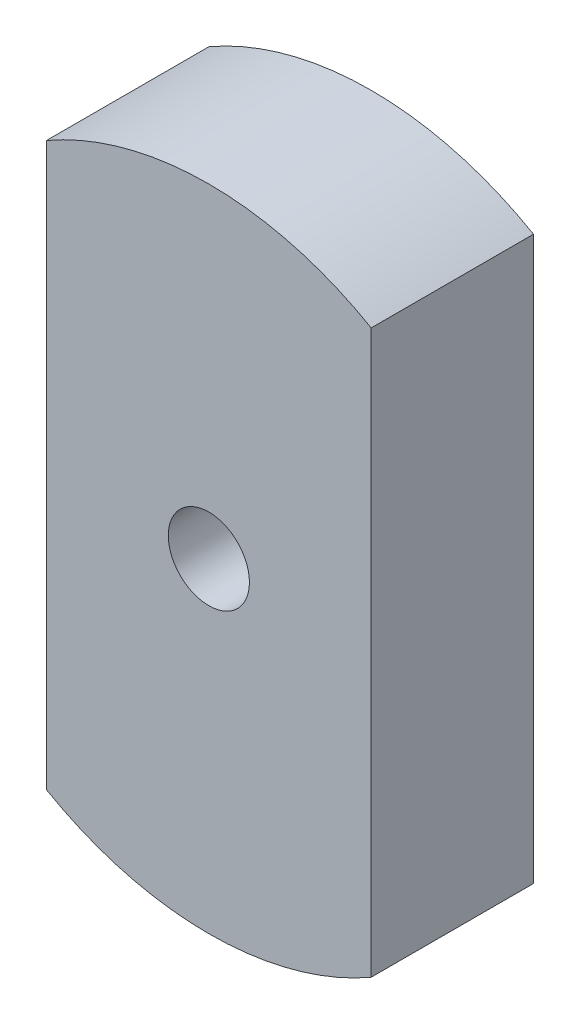
ISO-10303-21;
HEADER;
FILE_DESCRIPTION(('STEP AP214'),'2;1');
FILE_NAME('part.step','',(''),(''),'','','');
FILE_SCHEMA(('AUTOMOTIVE_DESIGN { 1 0 10303 214 1 1 1 1 }'));
ENDSEC;
DATA;
#1=APPLICATION_CONTEXT('core data for automotive mechanical design processes');
#2=APPLICATION_PROTOCOL_DEFINITION('international standard','automotive_design',2000,#1);
#3=PRODUCT_CONTEXT('',#1,'mechanical');
#4=PRODUCT('Part','Part','',(#3));
#5=PRODUCT_RELATED_PRODUCT_CATEGORY('part','',(#4));
#6=PRODUCT_DEFINITION_FORMATION('','',#4);
#7=PRODUCT_DEFINITION_CONTEXT('part definition',#1,'design');
#8=PRODUCT_DEFINITION('design','',#6,#7);
#9=PRODUCT_DEFINITION_SHAPE('','',#8);
#10=(LENGTH_UNIT() NAMED_UNIT(*) SI_UNIT(.MILLI.,.METRE.));
#11=(NAMED_UNIT(*) PLANE_ANGLE_UNIT() SI_UNIT($,.RADIAN.));
#12=(NAMED_UNIT(*) SI_UNIT($,.STERADIAN.) SOLID_ANGLE_UNIT());
#13=UNCERTAINTY_MEASURE_WITH_UNIT(LENGTH_MEASURE(1.E-05),#10,'distance_accuracy_value','');
#14=(GEOMETRIC_REPRESENTATION_CONTEXT(3) GLOBAL_UNCERTAINTY_ASSIGNED_CONTEXT((#13)) GLOBAL_UNIT_ASSIGNED_CONTEXT((#10,
#11,#12)) REPRESENTATION_CONTEXT('',''));
#15=CARTESIAN_POINT('',(0.,0.,0.));
#16=DIRECTION('',(0.,0.,1.));
#17=DIRECTION('',(1.,0.,0.));
#18=AXIS2_PLACEMENT_3D('',#15,#16,#17);
#19=CARTESIAN_POINT('',(5.,0.,5.));
#20=DIRECTION('',(1.,0.,0.));
#21=DIRECTION('',(0.,0.,-1.));
#22=AXIS2_PLACEMENT_3D('',#19,#20,#21);
#23=PLANE('',#22);
#24=DIRECTION('',(0.,-1.,0.));
#25=VECTOR('',#24,1.);
#26=CARTESIAN_POINT('',(5.,0.,0.));
#27=LINE('',#26,#25);
#28=CARTESIAN_POINT('',(5.,8.66025403784439,0.));
#29=VERTEX_POINT('',#28);
#30=CARTESIAN_POINT('',(5.,-8.66025403784439,0.));
#31=VERTEX_POINT('',#30);
#32=EDGE_CURVE('E104',#29,#31,#27,.T.);
#33=ORIENTED_EDGE('',*,*,#32,.F.);
#34=DIRECTION('',(0.,0.,-1.));
#35=VECTOR('',#34,1.);
#36=CARTESIAN_POINT('',(5.,8.66025403784439,5.));
#37=LINE('',#36,#35);
#38=CARTESIAN_POINT('',(5.,8.66025403784439,5.));
#39=VERTEX_POINT('',#38);
#40=EDGE_CURVE('E11',#39,#29,#37,.T.);
#41=ORIENTED_EDGE('',*,*,#40,.F.);
#42=DIRECTION('',(0.,-1.,0.));
#43=VECTOR('',#42,1.);
#44=CARTESIAN_POINT('',(5.,0.,5.));
#45=LINE('',#44,#43);
#46=CARTESIAN_POINT('',(5.,-8.66025403784439,5.));
#47=VERTEX_POINT('',#46);
#48=EDGE_CURVE('E92',#39,#47,#45,.T.);
#49=ORIENTED_EDGE('',*,*,#48,.T.);
#50=DIRECTION('',(0.,0.,-1.));
#51=VECTOR('',#50,1.);
#52=CARTESIAN_POINT('',(5.,-8.66025403784439,5.));
#53=LINE('',#52,#51);
#54=EDGE_CURVE('E74',#47,#31,#53,.T.);
#55=ORIENTED_EDGE('',*,*,#54,.T.);
#56=EDGE_LOOP('',(#33,#41,#49,#55));
#57=FACE_BOUND('',#56,.T.);
#58=ADVANCED_FACE('F35',(#57),#23,.T.);
#59=CARTESIAN_POINT('',(0.,0.,5.));
#60=DIRECTION('',(0.,0.,-1.));
#61=DIRECTION('',(-1.,0.,0.));
#62=AXIS2_PLACEMENT_3D('',#59,#60,#61);
#63=CYLINDRICAL_SURFACE('',#62,10.);
#64=CARTESIAN_POINT('',(0.,0.,0.));
#65=DIRECTION('',(0.,0.,1.));
#66=DIRECTION('',(1.,0.,0.));
#67=AXIS2_PLACEMENT_3D('',#64,#65,#66);
#68=CIRCLE('',#67,10.);
#69=CARTESIAN_POINT('',(-5.,8.66025403784439,0.));
#70=VERTEX_POINT('',#69);
#71=EDGE_CURVE('E97',#29,#70,#68,.T.);
#72=ORIENTED_EDGE('',*,*,#71,.T.);
#73=DIRECTION('',(0.,0.,-1.));
#74=VECTOR('',#73,1.);
#75=CARTESIAN_POINT('',(-5.,8.66025403784439,5.));
#76=LINE('',#75,#74);
#77=CARTESIAN_POINT('',(-5.,8.66025403784439,5.));
#78=VERTEX_POINT('',#77);
#79=EDGE_CURVE('E44',#78,#70,#76,.T.);
#80=ORIENTED_EDGE('',*,*,#79,.F.);
#81=CARTESIAN_POINT('',(0.,0.,5.));
#82=DIRECTION('',(0.,0.,1.));
#83=DIRECTION('',(1.,0.,0.));
#84=AXIS2_PLACEMENT_3D('',#81,#82,#83);
#85=CIRCLE('',#84,10.);
#86=EDGE_CURVE('E89',#39,#78,#85,.T.);
#87=ORIENTED_EDGE('',*,*,#86,.F.);
#88=ORIENTED_EDGE('',*,*,#40,.T.);
#89=EDGE_LOOP('',(#72,#80,#87,#88));
#90=FACE_BOUND('',#89,.T.);
#91=ADVANCED_FACE('F95',(#90),#63,.T.);
#92=CARTESIAN_POINT('',(-5.,0.,5.));
#93=DIRECTION('',(1.,0.,0.));
#94=DIRECTION('',(0.,0.,-1.));
#95=AXIS2_PLACEMENT_3D('',#92,#93,#94);
#96=PLANE('',#95);
#97=DIRECTION('',(0.,-1.,0.));
#98=VECTOR('',#97,1.);
#99=CARTESIAN_POINT('',(-5.,0.,0.));
#100=LINE('',#99,#98);
#101=CARTESIAN_POINT('',(-5.,-8.66025403784439,0.));
#102=VERTEX_POINT('',#101);
#103=EDGE_CURVE('E101',#70,#102,#100,.T.);
#104=ORIENTED_EDGE('',*,*,#103,.T.);
#105=DIRECTION('',(0.,0.,-1.));
#106=VECTOR('',#105,1.);
#107=CARTESIAN_POINT('',(-5.,-8.66025403784439,5.));
#108=LINE('',#107,#106);
#109=CARTESIAN_POINT('',(-5.,-8.66025403784439,5.));
#110=VERTEX_POINT('',#109);
#111=EDGE_CURVE('E88',#110,#102,#108,.T.);
#112=ORIENTED_EDGE('',*,*,#111,.F.);
#113=DIRECTION('',(0.,-1.,0.));
#114=VECTOR('',#113,1.);
#115=CARTESIAN_POINT('',(-5.,0.,5.));
#116=LINE('',#115,#114);
#117=EDGE_CURVE('E82',#78,#110,#116,.T.);
#118=ORIENTED_EDGE('',*,*,#117,.F.);
#119=ORIENTED_EDGE('',*,*,#79,.T.);
#120=EDGE_LOOP('',(#104,#112,#118,#119));
#121=FACE_BOUND('',#120,.T.);
#122=ADVANCED_FACE('F85',(#121),#96,.F.);
#123=CARTESIAN_POINT('',(0.,0.,5.));
#124=DIRECTION('',(0.,0.,-1.));
#125=DIRECTION('',(-1.,0.,0.));
#126=AXIS2_PLACEMENT_3D('',#123,#124,#125);
#127=CYLINDRICAL_SURFACE('',#126,1.25);
#128=CARTESIAN_POINT('',(0.,0.,5.));
#129=DIRECTION('',(0.,0.,1.));
#130=DIRECTION('',(1.,0.,0.));
#131=AXIS2_PLACEMENT_3D('',#128,#129,#130);
#132=CIRCLE('',#131,1.25);
#133=CARTESIAN_POINT('',(1.25,0.,5.));
#134=VERTEX_POINT('',#133);
#135=EDGE_CURVE('E110',#134,#134,#132,.T.);
#136=ORIENTED_EDGE('',*,*,#135,.T.);
#137=EDGE_LOOP('',(#136));
#138=FACE_BOUND('',#137,.T.);
#139=CARTESIAN_POINT('',(0.,0.,0.));
#140=DIRECTION('',(0.,0.,1.));
#141=DIRECTION('',(1.,0.,0.));
#142=AXIS2_PLACEMENT_3D('',#139,#140,#141);
#143=CIRCLE('',#142,1.25);
#144=CARTESIAN_POINT('',(1.25,0.,0.));
#145=VERTEX_POINT('',#144);
#146=EDGE_CURVE('E106',#145,#145,#143,.T.);
#147=ORIENTED_EDGE('',*,*,#146,.F.);
#148=EDGE_LOOP('',(#147));
#149=FACE_BOUND('',#148,.T.);
#150=ADVANCED_FACE('F37',(#138,#149),#127,.F.);
#151=EDGE_CURVE('E67',#102,#31,#68,.T.);
#152=ORIENTED_EDGE('',*,*,#151,.T.);
#153=ORIENTED_EDGE('',*,*,#54,.F.);
#154=EDGE_CURVE('E52',#110,#47,#85,.T.);
#155=ORIENTED_EDGE('',*,*,#154,.F.);
#156=ORIENTED_EDGE('',*,*,#111,.T.);
#157=EDGE_LOOP('',(#152,#153,#155,#156));
#158=FACE_BOUND('',#157,.T.);
#159=ADVANCED_FACE('F115',(#158),#63,.T.);
#160=CARTESIAN_POINT('',(0.,0.,5.));
#161=DIRECTION('',(0.,0.,1.));
#162=DIRECTION('',(1.,0.,0.));
#163=AXIS2_PLACEMENT_3D('',#160,#161,#162);
#164=PLANE('',#163);
#165=ORIENTED_EDGE('',*,*,#135,.F.);
#166=EDGE_LOOP('',(#165));
#167=FACE_BOUND('',#166,.T.);
#168=ORIENTED_EDGE('',*,*,#48,.F.);
#169=ORIENTED_EDGE('',*,*,#86,.T.);
#170=ORIENTED_EDGE('',*,*,#117,.T.);
#171=ORIENTED_EDGE('',*,*,#154,.T.);
#172=EDGE_LOOP('',(#168,#169,#170,#171));
#173=FACE_BOUND('',#172,.T.);
#174=ADVANCED_FACE('F91',(#167,#173),#164,.T.);
#175=CARTESIAN_POINT('',(0.,0.,0.));
#176=DIRECTION('',(0.,0.,1.));
#177=DIRECTION('',(1.,0.,0.));
#178=AXIS2_PLACEMENT_3D('',#175,#176,#177);
#179=PLANE('',#178);
#180=ORIENTED_EDGE('',*,*,#146,.T.);
#181=EDGE_LOOP('',(#180));
#182=FACE_BOUND('',#181,.T.);
#183=ORIENTED_EDGE('',*,*,#32,.T.);
#184=ORIENTED_EDGE('',*,*,#151,.F.);
#185=ORIENTED_EDGE('',*,*,#103,.F.);
#186=ORIENTED_EDGE('',*,*,#71,.F.);
#187=EDGE_LOOP('',(#183,#184,#185,#186));
#188=FACE_BOUND('',#187,.T.);
#189=ADVANCED_FACE('F116',(#182,#188),#179,.F.);
#190=CLOSED_SHELL('',(#58,#91,#122,#150,#159,#174,#189));
#191=MANIFOLD_SOLID_BREP('B2',#190);
#192=ADVANCED_BREP_SHAPE_REPRESENTATION('',(#18,#191),#14);
#193=SHAPE_DEFINITION_REPRESENTATION(#9,#192);
ENDSEC;
END-ISO-10303-21;
